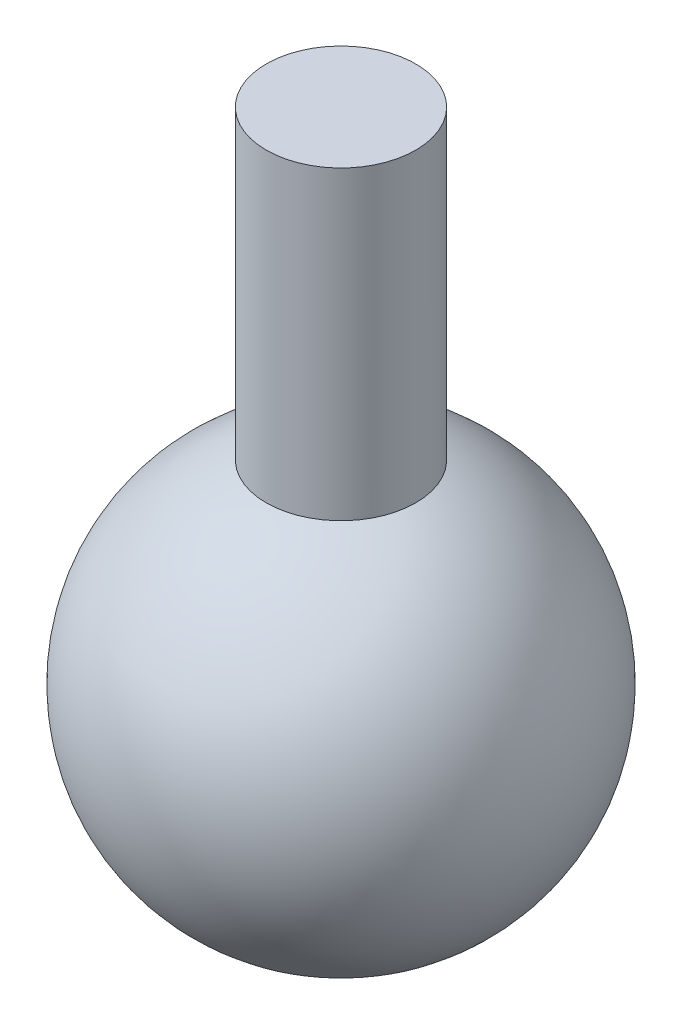
ISO-10303-21;
HEADER;
FILE_DESCRIPTION(('STEP AP214'),'2;1');
FILE_NAME('part.step','',(''),(''),'','','');
FILE_SCHEMA(('AUTOMOTIVE_DESIGN { 1 0 10303 214 1 1 1 1 }'));
ENDSEC;
DATA;
#1=APPLICATION_CONTEXT('core data for automotive mechanical design processes');
#2=APPLICATION_PROTOCOL_DEFINITION('international standard','automotive_design',2000,#1);
#3=PRODUCT_CONTEXT('',#1,'mechanical');
#4=PRODUCT('Part','Part','',(#3));
#5=PRODUCT_RELATED_PRODUCT_CATEGORY('part','',(#4));
#6=PRODUCT_DEFINITION_FORMATION('','',#4);
#7=PRODUCT_DEFINITION_CONTEXT('part definition',#1,'design');
#8=PRODUCT_DEFINITION('design','',#6,#7);
#9=PRODUCT_DEFINITION_SHAPE('','',#8);
#10=(LENGTH_UNIT() NAMED_UNIT(*) SI_UNIT(.MILLI.,.METRE.));
#11=(NAMED_UNIT(*) PLANE_ANGLE_UNIT() SI_UNIT($,.RADIAN.));
#12=(NAMED_UNIT(*) SI_UNIT($,.STERADIAN.) SOLID_ANGLE_UNIT());
#13=UNCERTAINTY_MEASURE_WITH_UNIT(LENGTH_MEASURE(1.E-05),#10,'distance_accuracy_value','');
#14=(GEOMETRIC_REPRESENTATION_CONTEXT(3) GLOBAL_UNCERTAINTY_ASSIGNED_CONTEXT((#13)) GLOBAL_UNIT_ASSIGNED_CONTEXT((#10,
#11,#12)) REPRESENTATION_CONTEXT('',''));
#15=CARTESIAN_POINT('',(0.,0.,0.));
#16=DIRECTION('',(0.,0.,1.));
#17=DIRECTION('',(1.,0.,0.));
#18=AXIS2_PLACEMENT_3D('',#15,#16,#17);
#19=CARTESIAN_POINT('',(0.,28.8806522160598,0.));
#20=DIRECTION('',(0.,-1.,0.));
#21=DIRECTION('',(0.,0.,-1.));
#22=AXIS2_PLACEMENT_3D('',#19,#20,#21);
#23=PLANE('',#22);
#24=CARTESIAN_POINT('',(0.,28.8806522160598,0.));
#25=DIRECTION('',(0.,1.,0.));
#26=DIRECTION('',(0.,0.,1.));
#27=AXIS2_PLACEMENT_3D('',#24,#25,#26);
#28=CIRCLE('',#27,4.31921365270604);
#29=CARTESIAN_POINT('',(0.,28.8806522160598,4.31921365270604));
#30=VERTEX_POINT('',#29);
#31=EDGE_CURVE('E38',#30,#30,#28,.T.);
#32=ORIENTED_EDGE('',*,*,#31,.T.);
#33=EDGE_LOOP('',(#32));
#34=FACE_BOUND('',#33,.T.);
#35=ADVANCED_FACE('F32',(#34),#23,.F.);
#36=CARTESIAN_POINT('',(0.,0.,0.));
#37=DIRECTION('',(0.,1.,0.));
#38=DIRECTION('',(1.,0.,0.));
#39=AXIS2_PLACEMENT_3D('',#36,#37,#38);
#40=SPHERICAL_SURFACE('',#39,12.0270799494164);
#41=CARTESIAN_POINT('',(0.,11.2247514686042,0.));
#42=DIRECTION('',(0.,1.,0.));
#43=DIRECTION('',(0.,0.,1.));
#44=AXIS2_PLACEMENT_3D('',#41,#42,#43);
#45=CIRCLE('',#44,4.31921365270605);
#46=CARTESIAN_POINT('',(0.,11.2247514686042,4.31921365270605));
#47=VERTEX_POINT('',#46);
#48=EDGE_CURVE('E10',#47,#47,#45,.T.);
#49=ORIENTED_EDGE('',*,*,#48,.F.);
#50=EDGE_LOOP('',(#49));
#51=FACE_BOUND('',#50,.T.);
#52=ADVANCED_FACE('F47',(#51),#40,.T.);
#53=CARTESIAN_POINT('',(0.,28.8806522160598,0.));
#54=DIRECTION('',(0.,1.,0.));
#55=DIRECTION('',(0.,0.,1.));
#56=AXIS2_PLACEMENT_3D('',#53,#54,#55);
#57=CYLINDRICAL_SURFACE('',#56,4.31921365270604);
#58=ORIENTED_EDGE('',*,*,#31,.F.);
#59=EDGE_LOOP('',(#58));
#60=FACE_BOUND('',#59,.T.);
#61=ORIENTED_EDGE('',*,*,#48,.T.);
#62=EDGE_LOOP('',(#61));
#63=FACE_BOUND('',#62,.T.);
#64=ADVANCED_FACE('F45',(#60,#63),#57,.T.);
#65=CLOSED_SHELL('',(#35,#52,#64));
#66=MANIFOLD_SOLID_BREP('B2',#65);
#67=ADVANCED_BREP_SHAPE_REPRESENTATION('',(#18,#66),#14);
#68=SHAPE_DEFINITION_REPRESENTATION(#9,#67);
ENDSEC;
END-ISO-10303-21;
